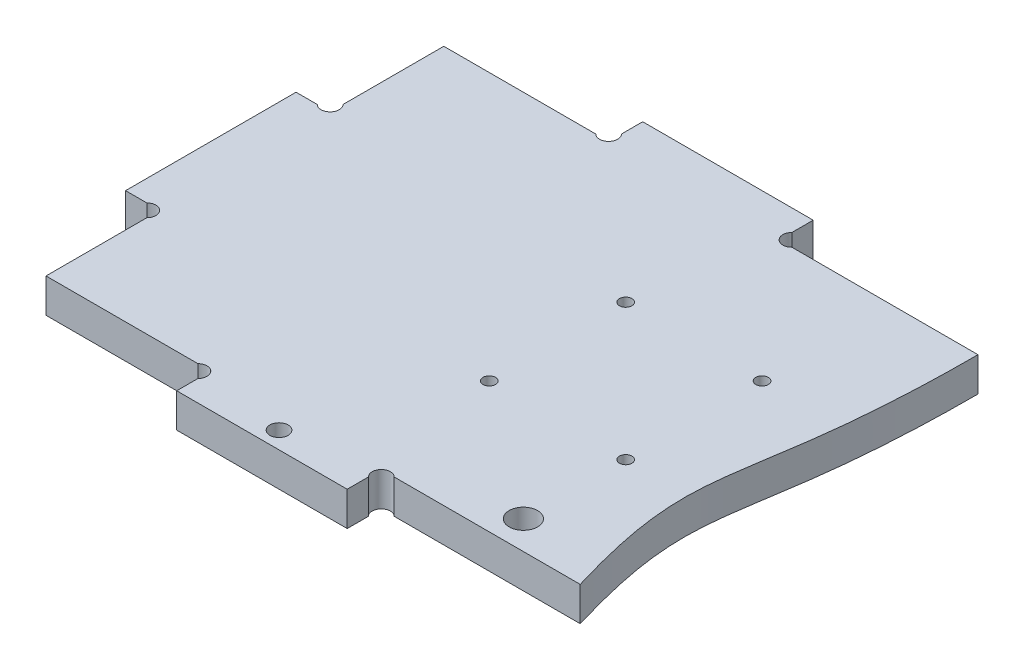
ISO-10303-21;
HEADER;
FILE_DESCRIPTION(('STEP AP214'),'2;1');
FILE_NAME('part.step','',(''),(''),'','','');
FILE_SCHEMA(('AUTOMOTIVE_DESIGN { 1 0 10303 214 1 1 1 1 }'));
ENDSEC;
DATA;
#1=APPLICATION_CONTEXT('core data for automotive mechanical design processes');
#2=APPLICATION_PROTOCOL_DEFINITION('international standard','automotive_design',2000,#1);
#3=PRODUCT_CONTEXT('',#1,'mechanical');
#4=PRODUCT('Part','Part','',(#3));
#5=PRODUCT_RELATED_PRODUCT_CATEGORY('part','',(#4));
#6=PRODUCT_DEFINITION_FORMATION('','',#4);
#7=PRODUCT_DEFINITION_CONTEXT('part definition',#1,'design');
#8=PRODUCT_DEFINITION('design','',#6,#7);
#9=PRODUCT_DEFINITION_SHAPE('','',#8);
#10=(LENGTH_UNIT() NAMED_UNIT(*) SI_UNIT(.MILLI.,.METRE.));
#11=(NAMED_UNIT(*) PLANE_ANGLE_UNIT() SI_UNIT($,.RADIAN.));
#12=(NAMED_UNIT(*) SI_UNIT($,.STERADIAN.) SOLID_ANGLE_UNIT());
#13=UNCERTAINTY_MEASURE_WITH_UNIT(LENGTH_MEASURE(1.E-05),#10,'distance_accuracy_value','');
#14=(GEOMETRIC_REPRESENTATION_CONTEXT(3) GLOBAL_UNCERTAINTY_ASSIGNED_CONTEXT((#13)) GLOBAL_UNIT_ASSIGNED_CONTEXT((#10,
#11,#12)) REPRESENTATION_CONTEXT('',''));
#15=CARTESIAN_POINT('',(0.,0.,0.));
#16=DIRECTION('',(0.,0.,1.));
#17=DIRECTION('',(1.,0.,0.));
#18=AXIS2_PLACEMENT_3D('',#15,#16,#17);
#19=CARTESIAN_POINT('',(33.8686291501015,6.,-4.86862915010151));
#20=DIRECTION('',(0.,1.,0.));
#21=DIRECTION('',(0.,0.,1.));
#22=AXIS2_PLACEMENT_3D('',#19,#20,#21);
#23=PLANE('',#22);
#24=CARTESIAN_POINT('',(85.,6.,-11.));
#25=DIRECTION('',(0.,1.,0.));
#26=DIRECTION('',(0.,0.,1.));
#27=AXIS2_PLACEMENT_3D('',#24,#25,#26);
#28=CIRCLE('',#27,2.5);
#29=CARTESIAN_POINT('',(85.,6.,-8.5));
#30=VERTEX_POINT('',#29);
#31=EDGE_CURVE('E509',#30,#30,#28,.T.);
#32=ORIENTED_EDGE('',*,*,#31,.F.);
#33=EDGE_LOOP('',(#32));
#34=FACE_BOUND('',#33,.T.);
#35=CARTESIAN_POINT('',(85.,6.,-29.));
#36=DIRECTION('',(0.,1.,0.));
#37=DIRECTION('',(0.,0.,1.));
#38=AXIS2_PLACEMENT_3D('',#35,#36,#37);
#39=CIRCLE('',#38,1.10000000000001);
#40=CARTESIAN_POINT('',(85.,6.,-27.9));
#41=VERTEX_POINT('',#40);
#42=EDGE_CURVE('E497',#41,#41,#39,.T.);
#43=ORIENTED_EDGE('',*,*,#42,.F.);
#44=EDGE_LOOP('',(#43));
#45=FACE_BOUND('',#44,.T.);
#46=CARTESIAN_POINT('',(85.,6.,-53.));
#47=DIRECTION('',(0.,1.,0.));
#48=DIRECTION('',(0.,0.,1.));
#49=AXIS2_PLACEMENT_3D('',#46,#47,#48);
#50=CIRCLE('',#49,1.10000000000001);
#51=CARTESIAN_POINT('',(85.,6.,-51.9));
#52=VERTEX_POINT('',#51);
#53=EDGE_CURVE('E217',#52,#52,#50,.T.);
#54=ORIENTED_EDGE('',*,*,#53,.F.);
#55=EDGE_LOOP('',(#54));
#56=FACE_BOUND('',#55,.T.);
#57=CARTESIAN_POINT('',(33.8686291501015,6.,-4.86862915010151));
#58=DIRECTION('',(0.,-1.,0.));
#59=DIRECTION('',(0.,0.,1.));
#60=AXIS2_PLACEMENT_3D('',#57,#58,#59);
#61=CIRCLE('',#60,1.60000000000001);
#62=CARTESIAN_POINT('',(32.737258300203,6.,-5.99999999999999));
#63=VERTEX_POINT('',#62);
#64=CARTESIAN_POINT('',(35.,6.,-3.73725830020303));
#65=VERTEX_POINT('',#64);
#66=EDGE_CURVE('E261',#63,#65,#61,.T.);
#67=ORIENTED_EDGE('',*,*,#66,.T.);
#68=DIRECTION('',(0.,0.,1.));
#69=VECTOR('',#68,1.);
#70=CARTESIAN_POINT('',(35.,6.,-3.73725830020303));
#71=LINE('',#70,#69);
#72=CARTESIAN_POINT('',(35.,6.,0.));
#73=VERTEX_POINT('',#72);
#74=EDGE_CURVE('E134',#65,#73,#71,.T.);
#75=ORIENTED_EDGE('',*,*,#74,.T.);
#76=DIRECTION('',(1.,0.,0.));
#77=VECTOR('',#76,1.);
#78=CARTESIAN_POINT('',(35.,6.,0.));
#79=LINE('',#78,#77);
#80=CARTESIAN_POINT('',(65.,6.,0.));
#81=VERTEX_POINT('',#80);
#82=EDGE_CURVE('E318',#73,#81,#79,.T.);
#83=ORIENTED_EDGE('',*,*,#82,.T.);
#84=DIRECTION('',(0.,0.,-1.));
#85=VECTOR('',#84,1.);
#86=CARTESIAN_POINT('',(65.,6.,0.));
#87=LINE('',#86,#85);
#88=CARTESIAN_POINT('',(65.,6.,-3.73725830020306));
#89=VERTEX_POINT('',#88);
#90=EDGE_CURVE('E337',#81,#89,#87,.T.);
#91=ORIENTED_EDGE('',*,*,#90,.T.);
#92=CARTESIAN_POINT('',(66.1313708498985,6.,-4.86862915010152));
#93=DIRECTION('',(0.,-1.,0.));
#94=DIRECTION('',(0.,0.,-1.));
#95=AXIS2_PLACEMENT_3D('',#92,#93,#94);
#96=CIRCLE('',#95,1.59999999999999);
#97=CARTESIAN_POINT('',(67.262741699797,6.,-5.99999999999999));
#98=VERTEX_POINT('',#97);
#99=EDGE_CURVE('E334',#89,#98,#96,.T.);
#100=ORIENTED_EDGE('',*,*,#99,.T.);
#101=DIRECTION('',(1.,0.,0.));
#102=VECTOR('',#101,1.);
#103=CARTESIAN_POINT('',(67.262741699797,6.,-5.99999999999999));
#104=LINE('',#103,#102);
#105=CARTESIAN_POINT('',(100.,6.,-5.99999999999987));
#106=VERTEX_POINT('',#105);
#107=EDGE_CURVE('E336',#98,#106,#104,.T.);
#108=ORIENTED_EDGE('',*,*,#107,.T.);
#109=CARTESIAN_POINT('',(100.,6.,-5.99999999999987));
#110=CARTESIAN_POINT('',(90.8729410608429,6.,-36.4661787427442));
#111=CARTESIAN_POINT('',(100.002627286202,6.,-33.8041680054416));
#112=CARTESIAN_POINT('',(100.,6.,-76.));
#113=B_SPLINE_CURVE_WITH_KNOTS('',3,(#109,#110,#111,#112),.UNSPECIFIED.,.F.,.F.,(4,4),(0.,1.),.UNSPECIFIED.);
#114=CARTESIAN_POINT('',(100.,6.,-76.));
#115=VERTEX_POINT('',#114);
#116=EDGE_CURVE('E339',#106,#115,#113,.T.);
#117=ORIENTED_EDGE('',*,*,#116,.T.);
#118=DIRECTION('',(-1.,0.,0.));
#119=VECTOR('',#118,1.);
#120=CARTESIAN_POINT('',(67.262741699797,6.,-76.));
#121=LINE('',#120,#119);
#122=CARTESIAN_POINT('',(67.262741699797,6.,-76.));
#123=VERTEX_POINT('',#122);
#124=EDGE_CURVE('E348',#115,#123,#121,.T.);
#125=ORIENTED_EDGE('',*,*,#124,.T.);
#126=CARTESIAN_POINT('',(66.1313708498985,6.,-77.1313708498985));
#127=DIRECTION('',(0.,-1.,0.));
#128=DIRECTION('',(0.,0.,1.));
#129=AXIS2_PLACEMENT_3D('',#126,#127,#128);
#130=CIRCLE('',#129,1.59999999999999);
#131=CARTESIAN_POINT('',(65.,6.,-78.2627416997969));
#132=VERTEX_POINT('',#131);
#133=EDGE_CURVE('E752',#123,#132,#130,.T.);
#134=ORIENTED_EDGE('',*,*,#133,.T.);
#135=DIRECTION('',(0.,0.,-1.));
#136=VECTOR('',#135,1.);
#137=CARTESIAN_POINT('',(65.,6.,-82.));
#138=LINE('',#137,#136);
#139=CARTESIAN_POINT('',(65.,6.,-82.));
#140=VERTEX_POINT('',#139);
#141=EDGE_CURVE('E451',#132,#140,#138,.T.);
#142=ORIENTED_EDGE('',*,*,#141,.T.);
#143=DIRECTION('',(-1.,0.,0.));
#144=VECTOR('',#143,1.);
#145=CARTESIAN_POINT('',(35.,6.,-82.));
#146=LINE('',#145,#144);
#147=CARTESIAN_POINT('',(35.,6.,-82.));
#148=VERTEX_POINT('',#147);
#149=EDGE_CURVE('E462',#140,#148,#146,.T.);
#150=ORIENTED_EDGE('',*,*,#149,.T.);
#151=DIRECTION('',(0.,0.,1.));
#152=VECTOR('',#151,1.);
#153=CARTESIAN_POINT('',(35.,6.,-78.262741699797));
#154=LINE('',#153,#152);
#155=CARTESIAN_POINT('',(35.,6.,-78.2627416997969));
#156=VERTEX_POINT('',#155);
#157=EDGE_CURVE('E459',#148,#156,#154,.T.);
#158=ORIENTED_EDGE('',*,*,#157,.T.);
#159=CARTESIAN_POINT('',(33.8686291501015,6.,-77.1313708498985));
#160=DIRECTION('',(0.,-1.,0.));
#161=DIRECTION('',(0.,0.,-1.));
#162=AXIS2_PLACEMENT_3D('',#159,#160,#161);
#163=CIRCLE('',#162,1.59999999999999);
#164=CARTESIAN_POINT('',(32.737258300203,6.,-76.));
#165=VERTEX_POINT('',#164);
#166=EDGE_CURVE('E461',#156,#165,#163,.T.);
#167=ORIENTED_EDGE('',*,*,#166,.T.);
#168=DIRECTION('',(-1.,0.,0.));
#169=VECTOR('',#168,1.);
#170=CARTESIAN_POINT('',(6.,6.,-76.));
#171=LINE('',#170,#169);
#172=CARTESIAN_POINT('',(6.,6.,-76.));
#173=VERTEX_POINT('',#172);
#174=EDGE_CURVE('E464',#165,#173,#171,.T.);
#175=ORIENTED_EDGE('',*,*,#174,.T.);
#176=DIRECTION('',(0.,0.,1.));
#177=VECTOR('',#176,1.);
#178=CARTESIAN_POINT('',(6.,6.,-58.262741699797));
#179=LINE('',#178,#177);
#180=CARTESIAN_POINT('',(6.,6.,-58.262741699797));
#181=VERTEX_POINT('',#180);
#182=EDGE_CURVE('E470',#173,#181,#179,.T.);
#183=ORIENTED_EDGE('',*,*,#182,.T.);
#184=CARTESIAN_POINT('',(4.86862915010153,6.,-57.1313708498985));
#185=DIRECTION('',(0.,-1.,0.));
#186=DIRECTION('',(0.,0.,-1.));
#187=AXIS2_PLACEMENT_3D('',#184,#185,#186);
#188=CIRCLE('',#187,1.6);
#189=CARTESIAN_POINT('',(3.73725830020306,6.,-56.));
#190=VERTEX_POINT('',#189);
#191=EDGE_CURVE('E472',#181,#190,#188,.T.);
#192=ORIENTED_EDGE('',*,*,#191,.T.);
#193=DIRECTION('',(-1.,0.,0.));
#194=VECTOR('',#193,1.);
#195=CARTESIAN_POINT('',(0.,6.,-56.));
#196=LINE('',#195,#194);
#197=CARTESIAN_POINT('',(0.,6.,-56.));
#198=VERTEX_POINT('',#197);
#199=EDGE_CURVE('E474',#190,#198,#196,.T.);
#200=ORIENTED_EDGE('',*,*,#199,.T.);
#201=DIRECTION('',(0.,0.,1.));
#202=VECTOR('',#201,1.);
#203=CARTESIAN_POINT('',(0.,6.,-26.));
#204=LINE('',#203,#202);
#205=CARTESIAN_POINT('',(0.,6.,-26.));
#206=VERTEX_POINT('',#205);
#207=EDGE_CURVE('E476',#198,#206,#204,.T.);
#208=ORIENTED_EDGE('',*,*,#207,.T.);
#209=DIRECTION('',(1.,0.,0.));
#210=VECTOR('',#209,1.);
#211=CARTESIAN_POINT('',(3.73725830020304,6.,-26.));
#212=LINE('',#211,#210);
#213=CARTESIAN_POINT('',(3.73725830020304,6.,-26.));
#214=VERTEX_POINT('',#213);
#215=EDGE_CURVE('E195',#206,#214,#212,.T.);
#216=ORIENTED_EDGE('',*,*,#215,.T.);
#217=CARTESIAN_POINT('',(4.86862915010152,6.,-24.8686291501015));
#218=DIRECTION('',(0.,-1.,0.));
#219=DIRECTION('',(0.,0.,1.));
#220=AXIS2_PLACEMENT_3D('',#217,#218,#219);
#221=CIRCLE('',#220,1.60000000000001);
#222=CARTESIAN_POINT('',(6.,6.,-23.737258300203));
#223=VERTEX_POINT('',#222);
#224=EDGE_CURVE('E189',#214,#223,#221,.T.);
#225=ORIENTED_EDGE('',*,*,#224,.T.);
#226=DIRECTION('',(0.,0.,1.));
#227=VECTOR('',#226,1.);
#228=CARTESIAN_POINT('',(6.,6.,-5.99999999999999));
#229=LINE('',#228,#227);
#230=CARTESIAN_POINT('',(6.,6.,-5.99999999999999));
#231=VERTEX_POINT('',#230);
#232=EDGE_CURVE('E193',#223,#231,#229,.T.);
#233=ORIENTED_EDGE('',*,*,#232,.T.);
#234=DIRECTION('',(1.,0.,0.));
#235=VECTOR('',#234,1.);
#236=CARTESIAN_POINT('',(32.737258300203,6.,-5.99999999999999));
#237=LINE('',#236,#235);
#238=EDGE_CURVE('E49',#231,#63,#237,.T.);
#239=ORIENTED_EDGE('',*,*,#238,.T.);
#240=EDGE_LOOP('',(#67,#75,#83,#91,#100,#108,#117,#125,#134,#142,#150,#158,#167,#175,#183,#192,
#200,#208,#216,#225,#233,#239));
#241=FACE_BOUND('',#240,.T.);
#242=CARTESIAN_POINT('',(61.,6.,-53.));
#243=DIRECTION('',(0.,1.,0.));
#244=DIRECTION('',(0.,0.,1.));
#245=AXIS2_PLACEMENT_3D('',#242,#243,#244);
#246=CIRCLE('',#245,1.1);
#247=CARTESIAN_POINT('',(61.,6.,-51.9));
#248=VERTEX_POINT('',#247);
#249=EDGE_CURVE('E491',#248,#248,#246,.T.);
#250=ORIENTED_EDGE('',*,*,#249,.F.);
#251=EDGE_LOOP('',(#250));
#252=FACE_BOUND('',#251,.T.);
#253=CARTESIAN_POINT('',(61.,6.,-29.));
#254=DIRECTION('',(0.,1.,0.));
#255=DIRECTION('',(0.,0.,1.));
#256=AXIS2_PLACEMENT_3D('',#253,#254,#255);
#257=CIRCLE('',#256,1.1);
#258=CARTESIAN_POINT('',(61.,6.,-27.9));
#259=VERTEX_POINT('',#258);
#260=EDGE_CURVE('E503',#259,#259,#257,.T.);
#261=ORIENTED_EDGE('',*,*,#260,.F.);
#262=EDGE_LOOP('',(#261));
#263=FACE_BOUND('',#262,.T.);
#264=CARTESIAN_POINT('',(50.,6.,-3.));
#265=DIRECTION('',(0.,1.,0.));
#266=DIRECTION('',(0.,0.,1.));
#267=AXIS2_PLACEMENT_3D('',#264,#265,#266);
#268=CIRCLE('',#267,1.6);
#269=CARTESIAN_POINT('',(50.,6.,-1.4));
#270=VERTEX_POINT('',#269);
#271=EDGE_CURVE('E515',#270,#270,#268,.T.);
#272=ORIENTED_EDGE('',*,*,#271,.F.);
#273=EDGE_LOOP('',(#272));
#274=FACE_BOUND('',#273,.T.);
#275=ADVANCED_FACE('F32',(#34,#45,#56,#241,#252,#263,#274),#23,.T.);
#276=CARTESIAN_POINT('',(33.8686291501015,0.,-4.86862915010151));
#277=DIRECTION('',(0.,1.,0.));
#278=DIRECTION('',(0.,0.,1.));
#279=AXIS2_PLACEMENT_3D('',#276,#277,#278);
#280=PLANE('',#279);
#281=CARTESIAN_POINT('',(85.,0.,-11.));
#282=DIRECTION('',(0.,1.,0.));
#283=DIRECTION('',(0.,0.,1.));
#284=AXIS2_PLACEMENT_3D('',#281,#282,#283);
#285=CIRCLE('',#284,2.5);
#286=CARTESIAN_POINT('',(85.,0.,-8.5));
#287=VERTEX_POINT('',#286);
#288=EDGE_CURVE('E512',#287,#287,#285,.T.);
#289=ORIENTED_EDGE('',*,*,#288,.T.);
#290=EDGE_LOOP('',(#289));
#291=FACE_BOUND('',#290,.T.);
#292=CARTESIAN_POINT('',(85.,0.,-29.));
#293=DIRECTION('',(0.,1.,0.));
#294=DIRECTION('',(0.,0.,1.));
#295=AXIS2_PLACEMENT_3D('',#292,#293,#294);
#296=CIRCLE('',#295,1.10000000000001);
#297=CARTESIAN_POINT('',(85.,0.,-27.9));
#298=VERTEX_POINT('',#297);
#299=EDGE_CURVE('E500',#298,#298,#296,.T.);
#300=ORIENTED_EDGE('',*,*,#299,.T.);
#301=EDGE_LOOP('',(#300));
#302=FACE_BOUND('',#301,.T.);
#303=CARTESIAN_POINT('',(85.,0.,-53.));
#304=DIRECTION('',(0.,1.,0.));
#305=DIRECTION('',(0.,0.,1.));
#306=AXIS2_PLACEMENT_3D('',#303,#304,#305);
#307=CIRCLE('',#306,1.10000000000001);
#308=CARTESIAN_POINT('',(85.,0.,-51.9));
#309=VERTEX_POINT('',#308);
#310=EDGE_CURVE('E488',#309,#309,#307,.T.);
#311=ORIENTED_EDGE('',*,*,#310,.T.);
#312=EDGE_LOOP('',(#311));
#313=FACE_BOUND('',#312,.T.);
#314=CARTESIAN_POINT('',(33.8686291501015,0.,-4.86862915010151));
#315=DIRECTION('',(0.,-1.,0.));
#316=DIRECTION('',(0.,0.,1.));
#317=AXIS2_PLACEMENT_3D('',#314,#315,#316);
#318=CIRCLE('',#317,1.60000000000001);
#319=CARTESIAN_POINT('',(32.737258300203,0.,-5.99999999999999));
#320=VERTEX_POINT('',#319);
#321=CARTESIAN_POINT('',(35.,0.,-3.73725830020303));
#322=VERTEX_POINT('',#321);
#323=EDGE_CURVE('E213',#320,#322,#318,.T.);
#324=ORIENTED_EDGE('',*,*,#323,.F.);
#325=DIRECTION('',(1.,0.,0.));
#326=VECTOR('',#325,1.);
#327=CARTESIAN_POINT('',(32.737258300203,0.,-5.99999999999999));
#328=LINE('',#327,#326);
#329=CARTESIAN_POINT('',(6.,0.,-5.99999999999999));
#330=VERTEX_POINT('',#329);
#331=EDGE_CURVE('E126',#330,#320,#328,.T.);
#332=ORIENTED_EDGE('',*,*,#331,.F.);
#333=DIRECTION('',(0.,0.,1.));
#334=VECTOR('',#333,1.);
#335=CARTESIAN_POINT('',(6.,0.,-5.99999999999999));
#336=LINE('',#335,#334);
#337=CARTESIAN_POINT('',(6.,0.,-23.737258300203));
#338=VERTEX_POINT('',#337);
#339=EDGE_CURVE('E120',#338,#330,#336,.T.);
#340=ORIENTED_EDGE('',*,*,#339,.F.);
#341=CARTESIAN_POINT('',(4.86862915010152,0.,-24.8686291501015));
#342=DIRECTION('',(0.,-1.,0.));
#343=DIRECTION('',(0.,0.,1.));
#344=AXIS2_PLACEMENT_3D('',#341,#342,#343);
#345=CIRCLE('',#344,1.60000000000001);
#346=CARTESIAN_POINT('',(3.73725830020304,0.,-26.));
#347=VERTEX_POINT('',#346);
#348=EDGE_CURVE('E203',#347,#338,#345,.T.);
#349=ORIENTED_EDGE('',*,*,#348,.F.);
#350=DIRECTION('',(1.,0.,0.));
#351=VECTOR('',#350,1.);
#352=CARTESIAN_POINT('',(3.73725830020304,0.,-26.));
#353=LINE('',#352,#351);
#354=CARTESIAN_POINT('',(0.,0.,-26.));
#355=VERTEX_POINT('',#354);
#356=EDGE_CURVE('E256',#355,#347,#353,.T.);
#357=ORIENTED_EDGE('',*,*,#356,.F.);
#358=DIRECTION('',(0.,0.,1.));
#359=VECTOR('',#358,1.);
#360=CARTESIAN_POINT('',(0.,0.,-26.));
#361=LINE('',#360,#359);
#362=CARTESIAN_POINT('',(0.,0.,-56.));
#363=VERTEX_POINT('',#362);
#364=EDGE_CURVE('E254',#363,#355,#361,.T.);
#365=ORIENTED_EDGE('',*,*,#364,.F.);
#366=DIRECTION('',(-1.,0.,0.));
#367=VECTOR('',#366,1.);
#368=CARTESIAN_POINT('',(0.,0.,-56.));
#369=LINE('',#368,#367);
#370=CARTESIAN_POINT('',(3.73725830020306,0.,-56.));
#371=VERTEX_POINT('',#370);
#372=EDGE_CURVE('E252',#371,#363,#369,.T.);
#373=ORIENTED_EDGE('',*,*,#372,.F.);
#374=CARTESIAN_POINT('',(4.86862915010153,0.,-57.1313708498985));
#375=DIRECTION('',(0.,-1.,0.));
#376=DIRECTION('',(0.,0.,-1.));
#377=AXIS2_PLACEMENT_3D('',#374,#375,#376);
#378=CIRCLE('',#377,1.6);
#379=CARTESIAN_POINT('',(6.,0.,-58.262741699797));
#380=VERTEX_POINT('',#379);
#381=EDGE_CURVE('E250',#380,#371,#378,.T.);
#382=ORIENTED_EDGE('',*,*,#381,.F.);
#383=DIRECTION('',(0.,0.,1.));
#384=VECTOR('',#383,1.);
#385=CARTESIAN_POINT('',(6.,0.,-58.262741699797));
#386=LINE('',#385,#384);
#387=CARTESIAN_POINT('',(6.,0.,-76.));
#388=VERTEX_POINT('',#387);
#389=EDGE_CURVE('E248',#388,#380,#386,.T.);
#390=ORIENTED_EDGE('',*,*,#389,.F.);
#391=DIRECTION('',(-1.,0.,0.));
#392=VECTOR('',#391,1.);
#393=CARTESIAN_POINT('',(6.,0.,-76.));
#394=LINE('',#393,#392);
#395=CARTESIAN_POINT('',(32.737258300203,0.,-76.));
#396=VERTEX_POINT('',#395);
#397=EDGE_CURVE('E246',#396,#388,#394,.T.);
#398=ORIENTED_EDGE('',*,*,#397,.F.);
#399=CARTESIAN_POINT('',(33.8686291501015,0.,-77.1313708498985));
#400=DIRECTION('',(0.,-1.,0.));
#401=DIRECTION('',(0.,0.,-1.));
#402=AXIS2_PLACEMENT_3D('',#399,#400,#401);
#403=CIRCLE('',#402,1.59999999999999);
#404=CARTESIAN_POINT('',(35.,0.,-78.2627416997969));
#405=VERTEX_POINT('',#404);
#406=EDGE_CURVE('E244',#405,#396,#403,.T.);
#407=ORIENTED_EDGE('',*,*,#406,.F.);
#408=DIRECTION('',(0.,0.,1.));
#409=VECTOR('',#408,1.);
#410=CARTESIAN_POINT('',(35.,0.,-78.262741699797));
#411=LINE('',#410,#409);
#412=CARTESIAN_POINT('',(35.,0.,-82.));
#413=VERTEX_POINT('',#412);
#414=EDGE_CURVE('E242',#413,#405,#411,.T.);
#415=ORIENTED_EDGE('',*,*,#414,.F.);
#416=DIRECTION('',(-1.,0.,0.));
#417=VECTOR('',#416,1.);
#418=CARTESIAN_POINT('',(35.,0.,-82.));
#419=LINE('',#418,#417);
#420=CARTESIAN_POINT('',(65.,0.,-82.));
#421=VERTEX_POINT('',#420);
#422=EDGE_CURVE('E240',#421,#413,#419,.T.);
#423=ORIENTED_EDGE('',*,*,#422,.F.);
#424=DIRECTION('',(0.,0.,-1.));
#425=VECTOR('',#424,1.);
#426=CARTESIAN_POINT('',(65.,0.,-82.));
#427=LINE('',#426,#425);
#428=CARTESIAN_POINT('',(65.,0.,-78.2627416997969));
#429=VERTEX_POINT('',#428);
#430=EDGE_CURVE('E238',#429,#421,#427,.T.);
#431=ORIENTED_EDGE('',*,*,#430,.F.);
#432=CARTESIAN_POINT('',(66.1313708498985,0.,-77.1313708498985));
#433=DIRECTION('',(0.,-1.,0.));
#434=DIRECTION('',(0.,0.,1.));
#435=AXIS2_PLACEMENT_3D('',#432,#433,#434);
#436=CIRCLE('',#435,1.59999999999999);
#437=CARTESIAN_POINT('',(67.262741699797,0.,-76.));
#438=VERTEX_POINT('',#437);
#439=EDGE_CURVE('E236',#438,#429,#436,.T.);
#440=ORIENTED_EDGE('',*,*,#439,.F.);
#441=DIRECTION('',(-1.,0.,0.));
#442=VECTOR('',#441,1.);
#443=CARTESIAN_POINT('',(67.262741699797,0.,-76.));
#444=LINE('',#443,#442);
#445=CARTESIAN_POINT('',(100.,0.,-76.));
#446=VERTEX_POINT('',#445);
#447=EDGE_CURVE('E231',#446,#438,#444,.T.);
#448=ORIENTED_EDGE('',*,*,#447,.F.);
#449=CARTESIAN_POINT('',(100.,0.,-5.99999999999987));
#450=CARTESIAN_POINT('',(90.8729410608429,0.,-36.4661787427442));
#451=CARTESIAN_POINT('',(100.002627286202,0.,-33.8041680054416));
#452=CARTESIAN_POINT('',(100.,0.,-76.));
#453=B_SPLINE_CURVE_WITH_KNOTS('',3,(#449,#450,#451,#452),.UNSPECIFIED.,.F.,.F.,(4,4),(0.,1.),.UNSPECIFIED.);
#454=CARTESIAN_POINT('',(100.,0.,-5.99999999999987));
#455=VERTEX_POINT('',#454);
#456=EDGE_CURVE('E227',#455,#446,#453,.T.);
#457=ORIENTED_EDGE('',*,*,#456,.F.);
#458=DIRECTION('',(1.,0.,0.));
#459=VECTOR('',#458,1.);
#460=CARTESIAN_POINT('',(67.262741699797,0.,-5.99999999999999));
#461=LINE('',#460,#459);
#462=CARTESIAN_POINT('',(67.262741699797,0.,-5.99999999999999));
#463=VERTEX_POINT('',#462);
#464=EDGE_CURVE('E225',#463,#455,#461,.T.);
#465=ORIENTED_EDGE('',*,*,#464,.F.);
#466=CARTESIAN_POINT('',(66.1313708498985,0.,-4.86862915010152));
#467=DIRECTION('',(0.,-1.,0.));
#468=DIRECTION('',(0.,0.,-1.));
#469=AXIS2_PLACEMENT_3D('',#466,#467,#468);
#470=CIRCLE('',#469,1.59999999999999);
#471=CARTESIAN_POINT('',(65.,0.,-3.73725830020306));
#472=VERTEX_POINT('',#471);
#473=EDGE_CURVE('E223',#472,#463,#470,.T.);
#474=ORIENTED_EDGE('',*,*,#473,.F.);
#475=DIRECTION('',(0.,0.,-1.));
#476=VECTOR('',#475,1.);
#477=CARTESIAN_POINT('',(65.,0.,0.));
#478=LINE('',#477,#476);
#479=CARTESIAN_POINT('',(65.,0.,0.));
#480=VERTEX_POINT('',#479);
#481=EDGE_CURVE('E221',#480,#472,#478,.T.);
#482=ORIENTED_EDGE('',*,*,#481,.F.);
#483=DIRECTION('',(1.,0.,0.));
#484=VECTOR('',#483,1.);
#485=CARTESIAN_POINT('',(35.,0.,0.));
#486=LINE('',#485,#484);
#487=CARTESIAN_POINT('',(35.,0.,0.));
#488=VERTEX_POINT('',#487);
#489=EDGE_CURVE('E219',#488,#480,#486,.T.);
#490=ORIENTED_EDGE('',*,*,#489,.F.);
#491=DIRECTION('',(0.,0.,1.));
#492=VECTOR('',#491,1.);
#493=CARTESIAN_POINT('',(35.,0.,-3.73725830020303));
#494=LINE('',#493,#492);
#495=EDGE_CURVE('E216',#322,#488,#494,.T.);
#496=ORIENTED_EDGE('',*,*,#495,.F.);
#497=EDGE_LOOP('',(#324,#332,#340,#349,#357,#365,#373,#382,#390,#398,#407,#415,#423,#431,#440,
#448,#457,#465,#474,#482,#490,#496));
#498=FACE_BOUND('',#497,.T.);
#499=CARTESIAN_POINT('',(61.,0.,-53.));
#500=DIRECTION('',(0.,1.,0.));
#501=DIRECTION('',(0.,0.,1.));
#502=AXIS2_PLACEMENT_3D('',#499,#500,#501);
#503=CIRCLE('',#502,1.1);
#504=CARTESIAN_POINT('',(61.,0.,-51.9));
#505=VERTEX_POINT('',#504);
#506=EDGE_CURVE('E494',#505,#505,#503,.T.);
#507=ORIENTED_EDGE('',*,*,#506,.T.);
#508=EDGE_LOOP('',(#507));
#509=FACE_BOUND('',#508,.T.);
#510=CARTESIAN_POINT('',(61.,0.,-29.));
#511=DIRECTION('',(0.,1.,0.));
#512=DIRECTION('',(0.,0.,1.));
#513=AXIS2_PLACEMENT_3D('',#510,#511,#512);
#514=CIRCLE('',#513,1.1);
#515=CARTESIAN_POINT('',(61.,0.,-27.9));
#516=VERTEX_POINT('',#515);
#517=EDGE_CURVE('E506',#516,#516,#514,.T.);
#518=ORIENTED_EDGE('',*,*,#517,.T.);
#519=EDGE_LOOP('',(#518));
#520=FACE_BOUND('',#519,.T.);
#521=CARTESIAN_POINT('',(50.,0.,-3.));
#522=DIRECTION('',(0.,1.,0.));
#523=DIRECTION('',(0.,0.,1.));
#524=AXIS2_PLACEMENT_3D('',#521,#522,#523);
#525=CIRCLE('',#524,1.6);
#526=CARTESIAN_POINT('',(50.,0.,-1.4));
#527=VERTEX_POINT('',#526);
#528=EDGE_CURVE('E518',#527,#527,#525,.T.);
#529=ORIENTED_EDGE('',*,*,#528,.T.);
#530=EDGE_LOOP('',(#529));
#531=FACE_BOUND('',#530,.T.);
#532=ADVANCED_FACE('F322',(#291,#302,#313,#498,#509,#520,#531),#280,.F.);
#533=CARTESIAN_POINT('',(33.8686291501015,6.,-4.86862915010151));
#534=DIRECTION('',(0.,-1.,0.));
#535=DIRECTION('',(0.,0.,-1.));
#536=AXIS2_PLACEMENT_3D('',#533,#534,#535);
#537=CYLINDRICAL_SURFACE('',#536,1.60000000000001);
#538=ORIENTED_EDGE('',*,*,#323,.T.);
#539=DIRECTION('',(0.,-1.,0.));
#540=VECTOR('',#539,1.);
#541=CARTESIAN_POINT('',(35.,6.,-3.73725830020303));
#542=LINE('',#541,#540);
#543=EDGE_CURVE('E11',#65,#322,#542,.T.);
#544=ORIENTED_EDGE('',*,*,#543,.F.);
#545=ORIENTED_EDGE('',*,*,#66,.F.);
#546=DIRECTION('',(0.,-1.,0.));
#547=VECTOR('',#546,1.);
#548=CARTESIAN_POINT('',(32.737258300203,6.,-5.99999999999999));
#549=LINE('',#548,#547);
#550=EDGE_CURVE('E209',#63,#320,#549,.T.);
#551=ORIENTED_EDGE('',*,*,#550,.T.);
#552=EDGE_LOOP('',(#538,#544,#545,#551));
#553=FACE_BOUND('',#552,.T.);
#554=ADVANCED_FACE('F34',(#553),#537,.F.);
#555=CARTESIAN_POINT('',(35.,6.,-3.73725830020303));
#556=DIRECTION('',(1.,0.,0.));
#557=DIRECTION('',(0.,0.,-1.));
#558=AXIS2_PLACEMENT_3D('',#555,#556,#557);
#559=PLANE('',#558);
#560=ORIENTED_EDGE('',*,*,#495,.T.);
#561=DIRECTION('',(0.,-1.,0.));
#562=VECTOR('',#561,1.);
#563=CARTESIAN_POINT('',(35.,6.,0.));
#564=LINE('',#563,#562);
#565=EDGE_CURVE('E41',#73,#488,#564,.T.);
#566=ORIENTED_EDGE('',*,*,#565,.F.);
#567=ORIENTED_EDGE('',*,*,#74,.F.);
#568=ORIENTED_EDGE('',*,*,#543,.T.);
#569=EDGE_LOOP('',(#560,#566,#567,#568));
#570=FACE_BOUND('',#569,.T.);
#571=ADVANCED_FACE('F370',(#570),#559,.F.);
#572=CARTESIAN_POINT('',(35.,6.,0.));
#573=DIRECTION('',(0.,0.,-1.));
#574=DIRECTION('',(-1.,0.,0.));
#575=AXIS2_PLACEMENT_3D('',#572,#573,#574);
#576=PLANE('',#575);
#577=ORIENTED_EDGE('',*,*,#489,.T.);
#578=DIRECTION('',(0.,-1.,0.));
#579=VECTOR('',#578,1.);
#580=CARTESIAN_POINT('',(65.,6.,0.));
#581=LINE('',#580,#579);
#582=EDGE_CURVE('E310',#81,#480,#581,.T.);
#583=ORIENTED_EDGE('',*,*,#582,.F.);
#584=ORIENTED_EDGE('',*,*,#82,.F.);
#585=ORIENTED_EDGE('',*,*,#565,.T.);
#586=EDGE_LOOP('',(#577,#583,#584,#585));
#587=FACE_BOUND('',#586,.T.);
#588=ADVANCED_FACE('F316',(#587),#576,.F.);
#589=CARTESIAN_POINT('',(65.,6.,0.));
#590=DIRECTION('',(-1.,0.,0.));
#591=DIRECTION('',(0.,0.,1.));
#592=AXIS2_PLACEMENT_3D('',#589,#590,#591);
#593=PLANE('',#592);
#594=ORIENTED_EDGE('',*,*,#481,.T.);
#595=DIRECTION('',(0.,-1.,0.));
#596=VECTOR('',#595,1.);
#597=CARTESIAN_POINT('',(65.,6.,-3.73725830020306));
#598=LINE('',#597,#596);
#599=EDGE_CURVE('E307',#89,#472,#598,.T.);
#600=ORIENTED_EDGE('',*,*,#599,.F.);
#601=ORIENTED_EDGE('',*,*,#90,.F.);
#602=ORIENTED_EDGE('',*,*,#582,.T.);
#603=EDGE_LOOP('',(#594,#600,#601,#602));
#604=FACE_BOUND('',#603,.T.);
#605=ADVANCED_FACE('F328',(#604),#593,.F.);
#606=CARTESIAN_POINT('',(66.1313708498985,6.,-4.86862915010152));
#607=DIRECTION('',(0.,-1.,0.));
#608=DIRECTION('',(0.,0.,-1.));
#609=AXIS2_PLACEMENT_3D('',#606,#607,#608);
#610=CYLINDRICAL_SURFACE('',#609,1.59999999999999);
#611=ORIENTED_EDGE('',*,*,#473,.T.);
#612=DIRECTION('',(0.,-1.,0.));
#613=VECTOR('',#612,1.);
#614=CARTESIAN_POINT('',(67.262741699797,6.,-5.99999999999999));
#615=LINE('',#614,#613);
#616=EDGE_CURVE('E304',#98,#463,#615,.T.);
#617=ORIENTED_EDGE('',*,*,#616,.F.);
#618=ORIENTED_EDGE('',*,*,#99,.F.);
#619=ORIENTED_EDGE('',*,*,#599,.T.);
#620=EDGE_LOOP('',(#611,#617,#618,#619));
#621=FACE_BOUND('',#620,.T.);
#622=ADVANCED_FACE('F332',(#621),#610,.F.);
#623=CARTESIAN_POINT('',(67.262741699797,6.,-5.99999999999999));
#624=DIRECTION('',(0.,0.,-1.));
#625=DIRECTION('',(-1.,0.,0.));
#626=AXIS2_PLACEMENT_3D('',#623,#624,#625);
#627=PLANE('',#626);
#628=ORIENTED_EDGE('',*,*,#464,.T.);
#629=DIRECTION('',(0.,-1.,0.));
#630=VECTOR('',#629,1.);
#631=CARTESIAN_POINT('',(100.,6.,-5.99999999999987));
#632=LINE('',#631,#630);
#633=EDGE_CURVE('E301',#106,#455,#632,.T.);
#634=ORIENTED_EDGE('',*,*,#633,.F.);
#635=ORIENTED_EDGE('',*,*,#107,.F.);
#636=ORIENTED_EDGE('',*,*,#616,.T.);
#637=EDGE_LOOP('',(#628,#634,#635,#636));
#638=FACE_BOUND('',#637,.T.);
#639=ADVANCED_FACE('F359',(#638),#627,.F.);
#640=DIRECTION('',(0.,-1.,0.));
#641=VECTOR('',#640,1.);
#642=SURFACE_OF_LINEAR_EXTRUSION('',#113,#641);
#643=ORIENTED_EDGE('',*,*,#456,.T.);
#644=DIRECTION('',(0.,-1.,0.));
#645=VECTOR('',#644,1.);
#646=CARTESIAN_POINT('',(100.,6.,-76.));
#647=LINE('',#646,#645);
#648=EDGE_CURVE('E298',#115,#446,#647,.T.);
#649=ORIENTED_EDGE('',*,*,#648,.F.);
#650=ORIENTED_EDGE('',*,*,#116,.F.);
#651=ORIENTED_EDGE('',*,*,#633,.T.);
#652=EDGE_LOOP('',(#643,#649,#650,#651));
#653=FACE_BOUND('',#652,.T.);
#654=ADVANCED_FACE('F354',(#653),#642,.F.);
#655=CARTESIAN_POINT('',(67.262741699797,6.,-76.));
#656=DIRECTION('',(0.,0.,1.));
#657=DIRECTION('',(1.,0.,0.));
#658=AXIS2_PLACEMENT_3D('',#655,#656,#657);
#659=PLANE('',#658);
#660=ORIENTED_EDGE('',*,*,#447,.T.);
#661=DIRECTION('',(0.,-1.,0.));
#662=VECTOR('',#661,1.);
#663=CARTESIAN_POINT('',(67.262741699797,6.,-76.));
#664=LINE('',#663,#662);
#665=EDGE_CURVE('E295',#123,#438,#664,.T.);
#666=ORIENTED_EDGE('',*,*,#665,.F.);
#667=ORIENTED_EDGE('',*,*,#124,.F.);
#668=ORIENTED_EDGE('',*,*,#648,.T.);
#669=EDGE_LOOP('',(#660,#666,#667,#668));
#670=FACE_BOUND('',#669,.T.);
#671=ADVANCED_FACE('F358',(#670),#659,.F.);
#672=CARTESIAN_POINT('',(66.1313708498985,6.,-77.1313708498985));
#673=DIRECTION('',(0.,-1.,0.));
#674=DIRECTION('',(0.,0.,-1.));
#675=AXIS2_PLACEMENT_3D('',#672,#673,#674);
#676=CYLINDRICAL_SURFACE('',#675,1.59999999999999);
#677=ORIENTED_EDGE('',*,*,#439,.T.);
#678=DIRECTION('',(0.,-1.,0.));
#679=VECTOR('',#678,1.);
#680=CARTESIAN_POINT('',(65.,6.,-78.2627416997969));
#681=LINE('',#680,#679);
#682=EDGE_CURVE('E292',#132,#429,#681,.T.);
#683=ORIENTED_EDGE('',*,*,#682,.F.);
#684=ORIENTED_EDGE('',*,*,#133,.F.);
#685=ORIENTED_EDGE('',*,*,#665,.T.);
#686=EDGE_LOOP('',(#677,#683,#684,#685));
#687=FACE_BOUND('',#686,.T.);
#688=ADVANCED_FACE('F435',(#687),#676,.F.);
#689=CARTESIAN_POINT('',(65.,6.,-82.));
#690=DIRECTION('',(-1.,0.,0.));
#691=DIRECTION('',(0.,0.,1.));
#692=AXIS2_PLACEMENT_3D('',#689,#690,#691);
#693=PLANE('',#692);
#694=ORIENTED_EDGE('',*,*,#430,.T.);
#695=DIRECTION('',(0.,-1.,0.));
#696=VECTOR('',#695,1.);
#697=CARTESIAN_POINT('',(65.,6.,-82.));
#698=LINE('',#697,#696);
#699=EDGE_CURVE('E289',#140,#421,#698,.T.);
#700=ORIENTED_EDGE('',*,*,#699,.F.);
#701=ORIENTED_EDGE('',*,*,#141,.F.);
#702=ORIENTED_EDGE('',*,*,#682,.T.);
#703=EDGE_LOOP('',(#694,#700,#701,#702));
#704=FACE_BOUND('',#703,.T.);
#705=ADVANCED_FACE('F432',(#704),#693,.F.);
#706=CARTESIAN_POINT('',(35.,6.,-82.));
#707=DIRECTION('',(0.,0.,1.));
#708=DIRECTION('',(1.,0.,0.));
#709=AXIS2_PLACEMENT_3D('',#706,#707,#708);
#710=PLANE('',#709);
#711=ORIENTED_EDGE('',*,*,#422,.T.);
#712=DIRECTION('',(0.,-1.,0.));
#713=VECTOR('',#712,1.);
#714=CARTESIAN_POINT('',(35.,6.,-82.));
#715=LINE('',#714,#713);
#716=EDGE_CURVE('E286',#148,#413,#715,.T.);
#717=ORIENTED_EDGE('',*,*,#716,.F.);
#718=ORIENTED_EDGE('',*,*,#149,.F.);
#719=ORIENTED_EDGE('',*,*,#699,.T.);
#720=EDGE_LOOP('',(#711,#717,#718,#719));
#721=FACE_BOUND('',#720,.T.);
#722=ADVANCED_FACE('F428',(#721),#710,.F.);
#723=CARTESIAN_POINT('',(35.,6.,-78.262741699797));
#724=DIRECTION('',(1.,0.,0.));
#725=DIRECTION('',(0.,0.,-1.));
#726=AXIS2_PLACEMENT_3D('',#723,#724,#725);
#727=PLANE('',#726);
#728=ORIENTED_EDGE('',*,*,#414,.T.);
#729=DIRECTION('',(0.,-1.,0.));
#730=VECTOR('',#729,1.);
#731=CARTESIAN_POINT('',(35.,6.,-78.2627416997969));
#732=LINE('',#731,#730);
#733=EDGE_CURVE('E283',#156,#405,#732,.T.);
#734=ORIENTED_EDGE('',*,*,#733,.F.);
#735=ORIENTED_EDGE('',*,*,#157,.F.);
#736=ORIENTED_EDGE('',*,*,#716,.T.);
#737=EDGE_LOOP('',(#728,#734,#735,#736));
#738=FACE_BOUND('',#737,.T.);
#739=ADVANCED_FACE('F424',(#738),#727,.F.);
#740=CARTESIAN_POINT('',(33.8686291501015,6.,-77.1313708498985));
#741=DIRECTION('',(0.,-1.,0.));
#742=DIRECTION('',(0.,0.,-1.));
#743=AXIS2_PLACEMENT_3D('',#740,#741,#742);
#744=CYLINDRICAL_SURFACE('',#743,1.59999999999999);
#745=ORIENTED_EDGE('',*,*,#406,.T.);
#746=DIRECTION('',(0.,-1.,0.));
#747=VECTOR('',#746,1.);
#748=CARTESIAN_POINT('',(32.737258300203,6.,-76.));
#749=LINE('',#748,#747);
#750=EDGE_CURVE('E280',#165,#396,#749,.T.);
#751=ORIENTED_EDGE('',*,*,#750,.F.);
#752=ORIENTED_EDGE('',*,*,#166,.F.);
#753=ORIENTED_EDGE('',*,*,#733,.T.);
#754=EDGE_LOOP('',(#745,#751,#752,#753));
#755=FACE_BOUND('',#754,.T.);
#756=ADVANCED_FACE('F420',(#755),#744,.F.);
#757=CARTESIAN_POINT('',(6.,6.,-76.));
#758=DIRECTION('',(0.,0.,1.));
#759=DIRECTION('',(1.,0.,0.));
#760=AXIS2_PLACEMENT_3D('',#757,#758,#759);
#761=PLANE('',#760);
#762=ORIENTED_EDGE('',*,*,#397,.T.);
#763=DIRECTION('',(0.,-1.,0.));
#764=VECTOR('',#763,1.);
#765=CARTESIAN_POINT('',(6.,6.,-76.));
#766=LINE('',#765,#764);
#767=EDGE_CURVE('E277',#173,#388,#766,.T.);
#768=ORIENTED_EDGE('',*,*,#767,.F.);
#769=ORIENTED_EDGE('',*,*,#174,.F.);
#770=ORIENTED_EDGE('',*,*,#750,.T.);
#771=EDGE_LOOP('',(#762,#768,#769,#770));
#772=FACE_BOUND('',#771,.T.);
#773=ADVANCED_FACE('F416',(#772),#761,.F.);
#774=CARTESIAN_POINT('',(6.,6.,-58.262741699797));
#775=DIRECTION('',(1.,0.,0.));
#776=DIRECTION('',(0.,0.,-1.));
#777=AXIS2_PLACEMENT_3D('',#774,#775,#776);
#778=PLANE('',#777);
#779=ORIENTED_EDGE('',*,*,#389,.T.);
#780=DIRECTION('',(0.,-1.,0.));
#781=VECTOR('',#780,1.);
#782=CARTESIAN_POINT('',(6.,6.,-58.262741699797));
#783=LINE('',#782,#781);
#784=EDGE_CURVE('E274',#181,#380,#783,.T.);
#785=ORIENTED_EDGE('',*,*,#784,.F.);
#786=ORIENTED_EDGE('',*,*,#182,.F.);
#787=ORIENTED_EDGE('',*,*,#767,.T.);
#788=EDGE_LOOP('',(#779,#785,#786,#787));
#789=FACE_BOUND('',#788,.T.);
#790=ADVANCED_FACE('F412',(#789),#778,.F.);
#791=CARTESIAN_POINT('',(4.86862915010153,6.,-57.1313708498985));
#792=DIRECTION('',(0.,-1.,0.));
#793=DIRECTION('',(0.,0.,-1.));
#794=AXIS2_PLACEMENT_3D('',#791,#792,#793);
#795=CYLINDRICAL_SURFACE('',#794,1.6);
#796=ORIENTED_EDGE('',*,*,#381,.T.);
#797=DIRECTION('',(0.,-1.,0.));
#798=VECTOR('',#797,1.);
#799=CARTESIAN_POINT('',(3.73725830020306,6.,-56.));
#800=LINE('',#799,#798);
#801=EDGE_CURVE('E271',#190,#371,#800,.T.);
#802=ORIENTED_EDGE('',*,*,#801,.F.);
#803=ORIENTED_EDGE('',*,*,#191,.F.);
#804=ORIENTED_EDGE('',*,*,#784,.T.);
#805=EDGE_LOOP('',(#796,#802,#803,#804));
#806=FACE_BOUND('',#805,.T.);
#807=ADVANCED_FACE('F408',(#806),#795,.F.);
#808=CARTESIAN_POINT('',(0.,6.,-56.));
#809=DIRECTION('',(0.,0.,1.));
#810=DIRECTION('',(1.,0.,0.));
#811=AXIS2_PLACEMENT_3D('',#808,#809,#810);
#812=PLANE('',#811);
#813=ORIENTED_EDGE('',*,*,#372,.T.);
#814=DIRECTION('',(0.,-1.,0.));
#815=VECTOR('',#814,1.);
#816=CARTESIAN_POINT('',(0.,6.,-56.));
#817=LINE('',#816,#815);
#818=EDGE_CURVE('E268',#198,#363,#817,.T.);
#819=ORIENTED_EDGE('',*,*,#818,.F.);
#820=ORIENTED_EDGE('',*,*,#199,.F.);
#821=ORIENTED_EDGE('',*,*,#801,.T.);
#822=EDGE_LOOP('',(#813,#819,#820,#821));
#823=FACE_BOUND('',#822,.T.);
#824=ADVANCED_FACE('F404',(#823),#812,.F.);
#825=CARTESIAN_POINT('',(0.,6.,-26.));
#826=DIRECTION('',(1.,0.,0.));
#827=DIRECTION('',(0.,0.,-1.));
#828=AXIS2_PLACEMENT_3D('',#825,#826,#827);
#829=PLANE('',#828);
#830=ORIENTED_EDGE('',*,*,#364,.T.);
#831=DIRECTION('',(0.,-1.,0.));
#832=VECTOR('',#831,1.);
#833=CARTESIAN_POINT('',(0.,6.,-26.));
#834=LINE('',#833,#832);
#835=EDGE_CURVE('E265',#206,#355,#834,.T.);
#836=ORIENTED_EDGE('',*,*,#835,.F.);
#837=ORIENTED_EDGE('',*,*,#207,.F.);
#838=ORIENTED_EDGE('',*,*,#818,.T.);
#839=EDGE_LOOP('',(#830,#836,#837,#838));
#840=FACE_BOUND('',#839,.T.);
#841=ADVANCED_FACE('F400',(#840),#829,.F.);
#842=CARTESIAN_POINT('',(3.73725830020304,6.,-26.));
#843=DIRECTION('',(0.,0.,-1.));
#844=DIRECTION('',(-1.,0.,0.));
#845=AXIS2_PLACEMENT_3D('',#842,#843,#844);
#846=PLANE('',#845);
#847=ORIENTED_EDGE('',*,*,#356,.T.);
#848=DIRECTION('',(0.,-1.,0.));
#849=VECTOR('',#848,1.);
#850=CARTESIAN_POINT('',(3.73725830020304,6.,-26.));
#851=LINE('',#850,#849);
#852=EDGE_CURVE('E204',#214,#347,#851,.T.);
#853=ORIENTED_EDGE('',*,*,#852,.F.);
#854=ORIENTED_EDGE('',*,*,#215,.F.);
#855=ORIENTED_EDGE('',*,*,#835,.T.);
#856=EDGE_LOOP('',(#847,#853,#854,#855));
#857=FACE_BOUND('',#856,.T.);
#858=ADVANCED_FACE('F397',(#857),#846,.F.);
#859=CARTESIAN_POINT('',(4.86862915010152,6.,-24.8686291501015));
#860=DIRECTION('',(0.,-1.,0.));
#861=DIRECTION('',(0.,0.,-1.));
#862=AXIS2_PLACEMENT_3D('',#859,#860,#861);
#863=CYLINDRICAL_SURFACE('',#862,1.60000000000001);
#864=ORIENTED_EDGE('',*,*,#348,.T.);
#865=DIRECTION('',(0.,-1.,0.));
#866=VECTOR('',#865,1.);
#867=CARTESIAN_POINT('',(6.,6.,-23.737258300203));
#868=LINE('',#867,#866);
#869=EDGE_CURVE('E200',#223,#338,#868,.T.);
#870=ORIENTED_EDGE('',*,*,#869,.F.);
#871=ORIENTED_EDGE('',*,*,#224,.F.);
#872=ORIENTED_EDGE('',*,*,#852,.T.);
#873=EDGE_LOOP('',(#864,#870,#871,#872));
#874=FACE_BOUND('',#873,.T.);
#875=ADVANCED_FACE('F201',(#874),#863,.F.);
#876=CARTESIAN_POINT('',(6.,6.,-5.99999999999999));
#877=DIRECTION('',(1.,0.,0.));
#878=DIRECTION('',(0.,0.,-1.));
#879=AXIS2_PLACEMENT_3D('',#876,#877,#878);
#880=PLANE('',#879);
#881=ORIENTED_EDGE('',*,*,#339,.T.);
#882=DIRECTION('',(0.,-1.,0.));
#883=VECTOR('',#882,1.);
#884=CARTESIAN_POINT('',(6.,6.,-5.99999999999999));
#885=LINE('',#884,#883);
#886=EDGE_CURVE('E205',#231,#330,#885,.T.);
#887=ORIENTED_EDGE('',*,*,#886,.F.);
#888=ORIENTED_EDGE('',*,*,#232,.F.);
#889=ORIENTED_EDGE('',*,*,#869,.T.);
#890=EDGE_LOOP('',(#881,#887,#888,#889));
#891=FACE_BOUND('',#890,.T.);
#892=ADVANCED_FACE('F207',(#891),#880,.F.);
#893=CARTESIAN_POINT('',(32.737258300203,6.,-5.99999999999999));
#894=DIRECTION('',(0.,0.,-1.));
#895=DIRECTION('',(-1.,0.,0.));
#896=AXIS2_PLACEMENT_3D('',#893,#894,#895);
#897=PLANE('',#896);
#898=ORIENTED_EDGE('',*,*,#331,.T.);
#899=ORIENTED_EDGE('',*,*,#550,.F.);
#900=ORIENTED_EDGE('',*,*,#238,.F.);
#901=ORIENTED_EDGE('',*,*,#886,.T.);
#902=EDGE_LOOP('',(#898,#899,#900,#901));
#903=FACE_BOUND('',#902,.T.);
#904=ADVANCED_FACE('F390',(#903),#897,.F.);
#905=CARTESIAN_POINT('',(85.,6.,-53.));
#906=DIRECTION('',(0.,-1.,0.));
#907=DIRECTION('',(0.,0.,-1.));
#908=AXIS2_PLACEMENT_3D('',#905,#906,#907);
#909=CYLINDRICAL_SURFACE('',#908,1.10000000000001);
#910=ORIENTED_EDGE('',*,*,#53,.T.);
#911=EDGE_LOOP('',(#910));
#912=FACE_BOUND('',#911,.T.);
#913=ORIENTED_EDGE('',*,*,#310,.F.);
#914=EDGE_LOOP('',(#913));
#915=FACE_BOUND('',#914,.T.);
#916=ADVANCED_FACE('F387',(#912,#915),#909,.F.);
#917=CARTESIAN_POINT('',(61.,6.,-53.));
#918=DIRECTION('',(0.,-1.,0.));
#919=DIRECTION('',(0.,0.,-1.));
#920=AXIS2_PLACEMENT_3D('',#917,#918,#919);
#921=CYLINDRICAL_SURFACE('',#920,1.1);
#922=ORIENTED_EDGE('',*,*,#249,.T.);
#923=EDGE_LOOP('',(#922));
#924=FACE_BOUND('',#923,.T.);
#925=ORIENTED_EDGE('',*,*,#506,.F.);
#926=EDGE_LOOP('',(#925));
#927=FACE_BOUND('',#926,.T.);
#928=ADVANCED_FACE('F544',(#924,#927),#921,.F.);
#929=CARTESIAN_POINT('',(85.,6.,-29.));
#930=DIRECTION('',(0.,-1.,0.));
#931=DIRECTION('',(0.,0.,-1.));
#932=AXIS2_PLACEMENT_3D('',#929,#930,#931);
#933=CYLINDRICAL_SURFACE('',#932,1.10000000000001);
#934=ORIENTED_EDGE('',*,*,#42,.T.);
#935=EDGE_LOOP('',(#934));
#936=FACE_BOUND('',#935,.T.);
#937=ORIENTED_EDGE('',*,*,#299,.F.);
#938=EDGE_LOOP('',(#937));
#939=FACE_BOUND('',#938,.T.);
#940=ADVANCED_FACE('F541',(#936,#939),#933,.F.);
#941=CARTESIAN_POINT('',(61.,6.,-29.));
#942=DIRECTION('',(0.,-1.,0.));
#943=DIRECTION('',(0.,0.,-1.));
#944=AXIS2_PLACEMENT_3D('',#941,#942,#943);
#945=CYLINDRICAL_SURFACE('',#944,1.1);
#946=ORIENTED_EDGE('',*,*,#260,.T.);
#947=EDGE_LOOP('',(#946));
#948=FACE_BOUND('',#947,.T.);
#949=ORIENTED_EDGE('',*,*,#517,.F.);
#950=EDGE_LOOP('',(#949));
#951=FACE_BOUND('',#950,.T.);
#952=ADVANCED_FACE('F535',(#948,#951),#945,.F.);
#953=CARTESIAN_POINT('',(85.,6.,-11.));
#954=DIRECTION('',(0.,-1.,0.));
#955=DIRECTION('',(0.,0.,-1.));
#956=AXIS2_PLACEMENT_3D('',#953,#954,#955);
#957=CYLINDRICAL_SURFACE('',#956,2.5);
#958=ORIENTED_EDGE('',*,*,#31,.T.);
#959=EDGE_LOOP('',(#958));
#960=FACE_BOUND('',#959,.T.);
#961=ORIENTED_EDGE('',*,*,#288,.F.);
#962=EDGE_LOOP('',(#961));
#963=FACE_BOUND('',#962,.T.);
#964=ADVANCED_FACE('F528',(#960,#963),#957,.F.);
#965=CARTESIAN_POINT('',(50.,6.,-3.));
#966=DIRECTION('',(0.,-1.,0.));
#967=DIRECTION('',(0.,0.,-1.));
#968=AXIS2_PLACEMENT_3D('',#965,#966,#967);
#969=CYLINDRICAL_SURFACE('',#968,1.6);
#970=ORIENTED_EDGE('',*,*,#271,.T.);
#971=EDGE_LOOP('',(#970));
#972=FACE_BOUND('',#971,.T.);
#973=ORIENTED_EDGE('',*,*,#528,.F.);
#974=EDGE_LOOP('',(#973));
#975=FACE_BOUND('',#974,.T.);
#976=ADVANCED_FACE('F524',(#972,#975),#969,.F.);
#977=CLOSED_SHELL('',(#275,#532,#554,#571,#588,#605,#622,#639,#654,#671,#688,#705,#722,#739,
#756,#773,#790,#807,#824,#841,#858,#875,#892,#904,#916,#928,#940,#952,#964,#976));
#978=MANIFOLD_SOLID_BREP('B2',#977);
#979=ADVANCED_BREP_SHAPE_REPRESENTATION('',(#18,#978),#14);
#980=SHAPE_DEFINITION_REPRESENTATION(#9,#979);
ENDSEC;
END-ISO-10303-21;
